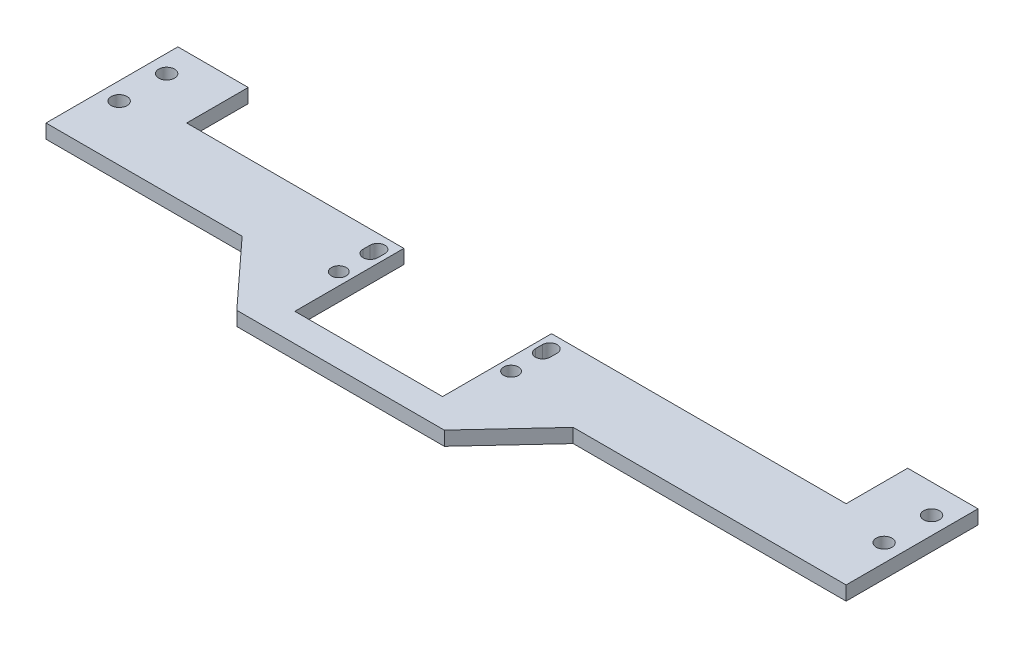
ISO-10303-21;
HEADER;
FILE_DESCRIPTION(('STEP AP214'),'2;1');
FILE_NAME('part.step','',(''),(''),'','','');
FILE_SCHEMA(('AUTOMOTIVE_DESIGN { 1 0 10303 214 1 1 1 1 }'));
ENDSEC;
DATA;
#1=APPLICATION_CONTEXT('core data for automotive mechanical design processes');
#2=APPLICATION_PROTOCOL_DEFINITION('international standard','automotive_design',2000,#1);
#3=PRODUCT_CONTEXT('',#1,'mechanical');
#4=PRODUCT('Part','Part','',(#3));
#5=PRODUCT_RELATED_PRODUCT_CATEGORY('part','',(#4));
#6=PRODUCT_DEFINITION_FORMATION('','',#4);
#7=PRODUCT_DEFINITION_CONTEXT('part definition',#1,'design');
#8=PRODUCT_DEFINITION('design','',#6,#7);
#9=PRODUCT_DEFINITION_SHAPE('','',#8);
#10=(LENGTH_UNIT() NAMED_UNIT(*) SI_UNIT(.MILLI.,.METRE.));
#11=(NAMED_UNIT(*) PLANE_ANGLE_UNIT() SI_UNIT($,.RADIAN.));
#12=(NAMED_UNIT(*) SI_UNIT($,.STERADIAN.) SOLID_ANGLE_UNIT());
#13=UNCERTAINTY_MEASURE_WITH_UNIT(LENGTH_MEASURE(1.E-05),#10,'distance_accuracy_value','');
#14=(GEOMETRIC_REPRESENTATION_CONTEXT(3) GLOBAL_UNCERTAINTY_ASSIGNED_CONTEXT((#13)) GLOBAL_UNIT_ASSIGNED_CONTEXT((#10,
#11,#12)) REPRESENTATION_CONTEXT('',''));
#15=CARTESIAN_POINT('',(0.,0.,0.));
#16=DIRECTION('',(0.,0.,1.));
#17=DIRECTION('',(1.,0.,0.));
#18=AXIS2_PLACEMENT_3D('',#15,#16,#17);
#19=CARTESIAN_POINT('',(0.,4.,0.));
#20=DIRECTION('',(0.,-1.,0.));
#21=DIRECTION('',(0.,0.,-1.));
#22=AXIS2_PLACEMENT_3D('',#19,#20,#21);
#23=PLANE('',#22);
#24=DIRECTION('',(1.,0.,0.));
#25=VECTOR('',#24,1.);
#26=CARTESIAN_POINT('',(-189.553457543323,4.,-5.54443477033133));
#27=LINE('',#26,#25);
#28=CARTESIAN_POINT('',(-206.886892884036,4.,-5.54443477033131));
#29=VERTEX_POINT('',#28);
#30=CARTESIAN_POINT('',(-151.115738532873,4.,-5.54443477033133));
#31=VERTEX_POINT('',#30);
#32=EDGE_CURVE('E223',#29,#31,#27,.T.);
#33=ORIENTED_EDGE('',*,*,#32,.T.);
#34=DIRECTION('',(0.677032314097707,0.,0.735953290411493));
#35=VECTOR('',#34,1.);
#36=CARTESIAN_POINT('',(-133.636892884036,4.,13.4555652296687));
#37=LINE('',#36,#35);
#38=CARTESIAN_POINT('',(-133.636892884036,4.,13.4555652296687));
#39=VERTEX_POINT('',#38);
#40=EDGE_CURVE('E211',#31,#39,#37,.T.);
#41=ORIENTED_EDGE('',*,*,#40,.T.);
#42=DIRECTION('',(1.,0.,0.));
#43=VECTOR('',#42,1.);
#44=CARTESIAN_POINT('',(-133.636892884036,4.,13.4555652296687));
#45=LINE('',#44,#43);
#46=CARTESIAN_POINT('',(-74.6368928840361,4.,13.4555652296687));
#47=VERTEX_POINT('',#46);
#48=EDGE_CURVE('E216',#39,#47,#45,.T.);
#49=ORIENTED_EDGE('',*,*,#48,.T.);
#50=DIRECTION('',(0.680746681944631,0.,-0.732518911033275));
#51=VECTOR('',#50,1.);
#52=CARTESIAN_POINT('',(-56.9797556250085,4.,-5.54443477033133));
#53=LINE('',#52,#51);
#54=CARTESIAN_POINT('',(-56.9797556250085,4.,-5.54443477033133));
#55=VERTEX_POINT('',#54);
#56=EDGE_CURVE('E59',#47,#55,#53,.T.);
#57=ORIENTED_EDGE('',*,*,#56,.T.);
#58=DIRECTION('',(1.,0.,0.));
#59=VECTOR('',#58,1.);
#60=CARTESIAN_POINT('',(-74.6368928840361,4.,-5.54443477033133));
#61=LINE('',#60,#59);
#62=CARTESIAN_POINT('',(20.6131071159638,4.,-5.54443477033133));
#63=VERTEX_POINT('',#62);
#64=EDGE_CURVE('E222',#55,#63,#61,.T.);
#65=ORIENTED_EDGE('',*,*,#64,.T.);
#66=DIRECTION('',(0.,0.,-1.));
#67=VECTOR('',#66,1.);
#68=CARTESIAN_POINT('',(20.6131071159638,4.,-5.54443477033133));
#69=LINE('',#68,#67);
#70=CARTESIAN_POINT('',(20.6131071159638,4.,-43.0444347703313));
#71=VERTEX_POINT('',#70);
#72=EDGE_CURVE('E403',#63,#71,#69,.T.);
#73=ORIENTED_EDGE('',*,*,#72,.T.);
#74=DIRECTION('',(-1.,0.,0.));
#75=VECTOR('',#74,1.);
#76=CARTESIAN_POINT('',(0.613107115963841,4.,-43.0444347703313));
#77=LINE('',#76,#75);
#78=CARTESIAN_POINT('',(0.613107115963841,4.,-43.0444347703313));
#79=VERTEX_POINT('',#78);
#80=EDGE_CURVE('E343',#71,#79,#77,.T.);
#81=ORIENTED_EDGE('',*,*,#80,.T.);
#82=DIRECTION('',(0.,0.,1.));
#83=VECTOR('',#82,1.);
#84=CARTESIAN_POINT('',(0.613107115963841,4.,-43.0444347703313));
#85=LINE('',#84,#83);
#86=CARTESIAN_POINT('',(0.613107115963837,4.,-25.5444347703313));
#87=VERTEX_POINT('',#86);
#88=EDGE_CURVE('E365',#79,#87,#85,.T.);
#89=ORIENTED_EDGE('',*,*,#88,.T.);
#90=DIRECTION('',(-1.,0.,0.));
#91=VECTOR('',#90,1.);
#92=CARTESIAN_POINT('',(-74.6368928840361,4.,-25.5444347703313));
#93=LINE('',#92,#91);
#94=CARTESIAN_POINT('',(-83.1368928840362,4.,-25.5444347703313));
#95=VERTEX_POINT('',#94);
#96=EDGE_CURVE('E361',#87,#95,#93,.T.);
#97=ORIENTED_EDGE('',*,*,#96,.T.);
#98=DIRECTION('',(0.,0.,1.));
#99=VECTOR('',#98,1.);
#100=CARTESIAN_POINT('',(-83.1368928840362,4.,-25.5444347703313));
#101=LINE('',#100,#99);
#102=CARTESIAN_POINT('',(-83.1368928840362,4.,5.45556522966867));
#103=VERTEX_POINT('',#102);
#104=EDGE_CURVE('E364',#95,#103,#101,.T.);
#105=ORIENTED_EDGE('',*,*,#104,.T.);
#106=DIRECTION('',(-1.,0.,0.));
#107=VECTOR('',#106,1.);
#108=CARTESIAN_POINT('',(-83.1368928840362,4.,5.45556522966867));
#109=LINE('',#108,#107);
#110=CARTESIAN_POINT('',(-125.136892884036,4.,5.45556522966867));
#111=VERTEX_POINT('',#110);
#112=EDGE_CURVE('E369',#103,#111,#109,.T.);
#113=ORIENTED_EDGE('',*,*,#112,.T.);
#114=DIRECTION('',(0.,0.,-1.));
#115=VECTOR('',#114,1.);
#116=CARTESIAN_POINT('',(-125.136892884036,4.,-25.5444347703313));
#117=LINE('',#116,#115);
#118=CARTESIAN_POINT('',(-125.136892884036,4.,-25.5444347703313));
#119=VERTEX_POINT('',#118);
#120=EDGE_CURVE('E376',#111,#119,#117,.T.);
#121=ORIENTED_EDGE('',*,*,#120,.T.);
#122=DIRECTION('',(-1.,0.,0.));
#123=VECTOR('',#122,1.);
#124=CARTESIAN_POINT('',(-125.136892884036,4.,-25.5444347703313));
#125=LINE('',#124,#123);
#126=CARTESIAN_POINT('',(-186.886892884036,4.,-25.5444347703313));
#127=VERTEX_POINT('',#126);
#128=EDGE_CURVE('E379',#119,#127,#125,.T.);
#129=ORIENTED_EDGE('',*,*,#128,.T.);
#130=DIRECTION('',(0.,0.,-1.));
#131=VECTOR('',#130,1.);
#132=CARTESIAN_POINT('',(-186.886892884036,4.,-43.0444347703313));
#133=LINE('',#132,#131);
#134=CARTESIAN_POINT('',(-186.886892884036,4.,-43.0444347703313));
#135=VERTEX_POINT('',#134);
#136=EDGE_CURVE('E308',#127,#135,#133,.T.);
#137=ORIENTED_EDGE('',*,*,#136,.T.);
#138=DIRECTION('',(-1.,0.,0.));
#139=VECTOR('',#138,1.);
#140=CARTESIAN_POINT('',(-206.886892884036,4.,-43.0444347703313));
#141=LINE('',#140,#139);
#142=CARTESIAN_POINT('',(-206.886892884036,4.,-43.0444347703313));
#143=VERTEX_POINT('',#142);
#144=EDGE_CURVE('E302',#135,#143,#141,.T.);
#145=ORIENTED_EDGE('',*,*,#144,.T.);
#146=DIRECTION('',(0.,0.,1.));
#147=VECTOR('',#146,1.);
#148=CARTESIAN_POINT('',(-206.886892884036,4.,-43.0444347703313));
#149=LINE('',#148,#147);
#150=EDGE_CURVE('E252',#143,#29,#149,.T.);
#151=ORIENTED_EDGE('',*,*,#150,.T.);
#152=EDGE_LOOP('',(#33,#41,#49,#57,#65,#73,#81,#89,#97,#105,#113,#121,#129,#137,#145,#151));
#153=FACE_BOUND('',#152,.T.);
#154=CARTESIAN_POINT('',(-128.636892884036,4.,-10.5444347703313));
#155=DIRECTION('',(0.,1.,0.));
#156=DIRECTION('',(0.,0.,1.));
#157=AXIS2_PLACEMENT_3D('',#154,#155,#156);
#158=CIRCLE('',#157,2.10000000000002);
#159=CARTESIAN_POINT('',(-128.636892884036,4.,-8.4444347703313));
#160=VERTEX_POINT('',#159);
#161=EDGE_CURVE('E481',#160,#160,#158,.T.);
#162=ORIENTED_EDGE('',*,*,#161,.F.);
#163=EDGE_LOOP('',(#162));
#164=FACE_BOUND('',#163,.T.);
#165=CARTESIAN_POINT('',(-79.6368928840362,4.,-21.5444347703313));
#166=DIRECTION('',(0.,1.,0.));
#167=DIRECTION('',(0.,0.,1.));
#168=AXIS2_PLACEMENT_3D('',#165,#166,#167);
#169=CIRCLE('',#168,2.1);
#170=CARTESIAN_POINT('',(-77.5368928840361,4.,-21.5444347703313));
#171=VERTEX_POINT('',#170);
#172=CARTESIAN_POINT('',(-81.7368928840362,4.,-21.5444347703313));
#173=VERTEX_POINT('',#172);
#174=EDGE_CURVE('E489',#171,#173,#169,.T.);
#175=ORIENTED_EDGE('',*,*,#174,.F.);
#176=DIRECTION('',(0.,0.,-1.));
#177=VECTOR('',#176,1.);
#178=CARTESIAN_POINT('',(-77.5368928840361,4.,-21.5444347703313));
#179=LINE('',#178,#177);
#180=CARTESIAN_POINT('',(-77.5368928840361,4.,-19.5444347703313));
#181=VERTEX_POINT('',#180);
#182=EDGE_CURVE('E500',#181,#171,#179,.T.);
#183=ORIENTED_EDGE('',*,*,#182,.F.);
#184=CARTESIAN_POINT('',(-79.6368928840362,4.,-19.5444347703313));
#185=DIRECTION('',(0.,1.,0.));
#186=DIRECTION('',(0.,0.,1.));
#187=AXIS2_PLACEMENT_3D('',#184,#185,#186);
#188=CIRCLE('',#187,2.1);
#189=CARTESIAN_POINT('',(-81.7368928840362,4.,-19.5444347703313));
#190=VERTEX_POINT('',#189);
#191=EDGE_CURVE('E496',#190,#181,#188,.T.);
#192=ORIENTED_EDGE('',*,*,#191,.F.);
#193=DIRECTION('',(0.,0.,1.));
#194=VECTOR('',#193,1.);
#195=CARTESIAN_POINT('',(-81.7368928840362,4.,-21.5444347703313));
#196=LINE('',#195,#194);
#197=EDGE_CURVE('E492',#173,#190,#196,.T.);
#198=ORIENTED_EDGE('',*,*,#197,.F.);
#199=EDGE_LOOP('',(#175,#183,#192,#198));
#200=FACE_BOUND('',#199,.T.);
#201=CARTESIAN_POINT('',(15.6131071159638,4.,-34.8444347703313));
#202=DIRECTION('',(0.,1.,0.));
#203=DIRECTION('',(0.,0.,1.));
#204=AXIS2_PLACEMENT_3D('',#201,#202,#203);
#205=CIRCLE('',#204,2.25);
#206=CARTESIAN_POINT('',(15.6131071159638,4.,-32.5944347703313));
#207=VERTEX_POINT('',#206);
#208=EDGE_CURVE('E265',#207,#207,#205,.T.);
#209=ORIENTED_EDGE('',*,*,#208,.F.);
#210=EDGE_LOOP('',(#209));
#211=FACE_BOUND('',#210,.T.);
#212=CARTESIAN_POINT('',(15.6131071159639,4.,-21.3444347703313));
#213=DIRECTION('',(0.,1.,0.));
#214=DIRECTION('',(0.,0.,1.));
#215=AXIS2_PLACEMENT_3D('',#212,#213,#214);
#216=CIRCLE('',#215,2.25);
#217=CARTESIAN_POINT('',(15.6131071159639,4.,-19.0944347703313));
#218=VERTEX_POINT('',#217);
#219=EDGE_CURVE('E540',#218,#218,#216,.T.);
#220=ORIENTED_EDGE('',*,*,#219,.F.);
#221=EDGE_LOOP('',(#220));
#222=FACE_BOUND('',#221,.T.);
#223=CARTESIAN_POINT('',(-79.6368928840362,4.,-10.5444347703313));
#224=DIRECTION('',(0.,1.,0.));
#225=DIRECTION('',(0.,0.,1.));
#226=AXIS2_PLACEMENT_3D('',#223,#224,#225);
#227=CIRCLE('',#226,2.1);
#228=CARTESIAN_POINT('',(-79.6368928840362,4.,-8.44443477033133));
#229=VERTEX_POINT('',#228);
#230=EDGE_CURVE('E532',#229,#229,#227,.T.);
#231=ORIENTED_EDGE('',*,*,#230,.F.);
#232=EDGE_LOOP('',(#231));
#233=FACE_BOUND('',#232,.T.);
#234=CARTESIAN_POINT('',(-128.636892884036,4.,-19.5444347703313));
#235=DIRECTION('',(0.,1.,0.));
#236=DIRECTION('',(0.,0.,-1.));
#237=AXIS2_PLACEMENT_3D('',#234,#235,#236);
#238=CIRCLE('',#237,2.1);
#239=CARTESIAN_POINT('',(-130.736892884036,4.,-19.5444347703313));
#240=VERTEX_POINT('',#239);
#241=CARTESIAN_POINT('',(-126.536892884036,4.,-19.5444347703313));
#242=VERTEX_POINT('',#241);
#243=EDGE_CURVE('E440',#240,#242,#238,.T.);
#244=ORIENTED_EDGE('',*,*,#243,.F.);
#245=DIRECTION('',(0.,0.,1.));
#246=VECTOR('',#245,1.);
#247=CARTESIAN_POINT('',(-130.736892884036,4.,-21.5444347703313));
#248=LINE('',#247,#246);
#249=CARTESIAN_POINT('',(-130.736892884036,4.,-21.5444347703313));
#250=VERTEX_POINT('',#249);
#251=EDGE_CURVE('E450',#250,#240,#248,.T.);
#252=ORIENTED_EDGE('',*,*,#251,.F.);
#253=CARTESIAN_POINT('',(-128.636892884036,4.,-21.5444347703313));
#254=DIRECTION('',(0.,1.,0.));
#255=DIRECTION('',(0.,0.,-1.));
#256=AXIS2_PLACEMENT_3D('',#253,#254,#255);
#257=CIRCLE('',#256,2.1);
#258=CARTESIAN_POINT('',(-126.536892884036,4.,-21.5444347703313));
#259=VERTEX_POINT('',#258);
#260=EDGE_CURVE('E447',#259,#250,#257,.T.);
#261=ORIENTED_EDGE('',*,*,#260,.F.);
#262=DIRECTION('',(0.,0.,-1.));
#263=VECTOR('',#262,1.);
#264=CARTESIAN_POINT('',(-126.536892884036,4.,-21.5444347703313));
#265=LINE('',#264,#263);
#266=EDGE_CURVE('E443',#242,#259,#265,.T.);
#267=ORIENTED_EDGE('',*,*,#266,.F.);
#268=EDGE_LOOP('',(#244,#252,#261,#267));
#269=FACE_BOUND('',#268,.T.);
#270=CARTESIAN_POINT('',(-201.886892884036,4.,-34.8444347703313));
#271=DIRECTION('',(0.,1.,0.));
#272=DIRECTION('',(0.,0.,1.));
#273=AXIS2_PLACEMENT_3D('',#270,#271,#272);
#274=CIRCLE('',#273,2.25000000000001);
#275=CARTESIAN_POINT('',(-201.886892884036,4.,-32.5944347703313));
#276=VERTEX_POINT('',#275);
#277=EDGE_CURVE('E432',#276,#276,#274,.T.);
#278=ORIENTED_EDGE('',*,*,#277,.F.);
#279=EDGE_LOOP('',(#278));
#280=FACE_BOUND('',#279,.T.);
#281=CARTESIAN_POINT('',(-201.886892884036,4.,-21.3444347703313));
#282=DIRECTION('',(0.,1.,0.));
#283=DIRECTION('',(0.,0.,1.));
#284=AXIS2_PLACEMENT_3D('',#281,#282,#283);
#285=CIRCLE('',#284,2.25000000000001);
#286=CARTESIAN_POINT('',(-201.886892884036,4.,-19.0944347703313));
#287=VERTEX_POINT('',#286);
#288=EDGE_CURVE('E424',#287,#287,#285,.T.);
#289=ORIENTED_EDGE('',*,*,#288,.F.);
#290=EDGE_LOOP('',(#289));
#291=FACE_BOUND('',#290,.T.);
#292=ADVANCED_FACE('F43',(#153,#164,#200,#211,#222,#233,#269,#280,#291),#23,.F.);
#293=CARTESIAN_POINT('',(0.,0.,0.));
#294=DIRECTION('',(0.,-1.,0.));
#295=DIRECTION('',(0.,0.,-1.));
#296=AXIS2_PLACEMENT_3D('',#293,#294,#295);
#297=PLANE('',#296);
#298=DIRECTION('',(0.677032314097707,0.,0.735953290411493));
#299=VECTOR('',#298,1.);
#300=CARTESIAN_POINT('',(-133.636892884036,0.,13.4555652296687));
#301=LINE('',#300,#299);
#302=CARTESIAN_POINT('',(-151.115738532873,0.,-5.54443477033133));
#303=VERTEX_POINT('',#302);
#304=CARTESIAN_POINT('',(-133.636892884036,0.,13.4555652296687));
#305=VERTEX_POINT('',#304);
#306=EDGE_CURVE('E415',#303,#305,#301,.T.);
#307=ORIENTED_EDGE('',*,*,#306,.F.);
#308=DIRECTION('',(1.,0.,0.));
#309=VECTOR('',#308,1.);
#310=CARTESIAN_POINT('',(-133.636892884036,0.,-5.54443477033133));
#311=LINE('',#310,#309);
#312=CARTESIAN_POINT('',(-206.886892884036,0.,-5.54443477033131));
#313=VERTEX_POINT('',#312);
#314=EDGE_CURVE('E248',#313,#303,#311,.T.);
#315=ORIENTED_EDGE('',*,*,#314,.F.);
#316=DIRECTION('',(0.,0.,1.));
#317=VECTOR('',#316,1.);
#318=CARTESIAN_POINT('',(-206.886892884036,0.,-43.0444347703313));
#319=LINE('',#318,#317);
#320=CARTESIAN_POINT('',(-206.886892884036,0.,-43.0444347703313));
#321=VERTEX_POINT('',#320);
#322=EDGE_CURVE('E254',#321,#313,#319,.T.);
#323=ORIENTED_EDGE('',*,*,#322,.F.);
#324=DIRECTION('',(-1.,0.,0.));
#325=VECTOR('',#324,1.);
#326=CARTESIAN_POINT('',(-206.886892884036,0.,-43.0444347703313));
#327=LINE('',#326,#325);
#328=CARTESIAN_POINT('',(-186.886892884036,0.,-43.0444347703313));
#329=VERTEX_POINT('',#328);
#330=EDGE_CURVE('E260',#329,#321,#327,.T.);
#331=ORIENTED_EDGE('',*,*,#330,.F.);
#332=DIRECTION('',(0.,0.,-1.));
#333=VECTOR('',#332,1.);
#334=CARTESIAN_POINT('',(-186.886892884036,0.,-43.0444347703313));
#335=LINE('',#334,#333);
#336=CARTESIAN_POINT('',(-186.886892884036,0.,-25.5444347703313));
#337=VERTEX_POINT('',#336);
#338=EDGE_CURVE('E299',#337,#329,#335,.T.);
#339=ORIENTED_EDGE('',*,*,#338,.F.);
#340=DIRECTION('',(-1.,0.,0.));
#341=VECTOR('',#340,1.);
#342=CARTESIAN_POINT('',(-125.136892884036,0.,-25.5444347703313));
#343=LINE('',#342,#341);
#344=CARTESIAN_POINT('',(-125.136892884036,0.,-25.5444347703313));
#345=VERTEX_POINT('',#344);
#346=EDGE_CURVE('E296',#345,#337,#343,.T.);
#347=ORIENTED_EDGE('',*,*,#346,.F.);
#348=DIRECTION('',(0.,0.,-1.));
#349=VECTOR('',#348,1.);
#350=CARTESIAN_POINT('',(-125.136892884036,0.,-25.5444347703313));
#351=LINE('',#350,#349);
#352=CARTESIAN_POINT('',(-125.136892884036,0.,5.45556522966867));
#353=VERTEX_POINT('',#352);
#354=EDGE_CURVE('E293',#353,#345,#351,.T.);
#355=ORIENTED_EDGE('',*,*,#354,.F.);
#356=DIRECTION('',(-1.,0.,0.));
#357=VECTOR('',#356,1.);
#358=CARTESIAN_POINT('',(-83.1368928840362,0.,5.45556522966867));
#359=LINE('',#358,#357);
#360=CARTESIAN_POINT('',(-83.1368928840362,0.,5.45556522966867));
#361=VERTEX_POINT('',#360);
#362=EDGE_CURVE('E290',#361,#353,#359,.T.);
#363=ORIENTED_EDGE('',*,*,#362,.F.);
#364=DIRECTION('',(0.,0.,1.));
#365=VECTOR('',#364,1.);
#366=CARTESIAN_POINT('',(-83.1368928840362,0.,-25.5444347703313));
#367=LINE('',#366,#365);
#368=CARTESIAN_POINT('',(-83.1368928840362,0.,-25.5444347703313));
#369=VERTEX_POINT('',#368);
#370=EDGE_CURVE('E287',#369,#361,#367,.T.);
#371=ORIENTED_EDGE('',*,*,#370,.F.);
#372=DIRECTION('',(-1.,0.,0.));
#373=VECTOR('',#372,1.);
#374=CARTESIAN_POINT('',(-83.1368928840362,0.,-25.5444347703313));
#375=LINE('',#374,#373);
#376=CARTESIAN_POINT('',(0.613107115963837,0.,-25.5444347703313));
#377=VERTEX_POINT('',#376);
#378=EDGE_CURVE('E284',#377,#369,#375,.T.);
#379=ORIENTED_EDGE('',*,*,#378,.F.);
#380=DIRECTION('',(0.,0.,1.));
#381=VECTOR('',#380,1.);
#382=CARTESIAN_POINT('',(0.613107115963841,0.,-43.0444347703313));
#383=LINE('',#382,#381);
#384=CARTESIAN_POINT('',(0.613107115963841,0.,-43.0444347703313));
#385=VERTEX_POINT('',#384);
#386=EDGE_CURVE('E280',#385,#377,#383,.T.);
#387=ORIENTED_EDGE('',*,*,#386,.F.);
#388=DIRECTION('',(-1.,0.,0.));
#389=VECTOR('',#388,1.);
#390=CARTESIAN_POINT('',(0.613107115963841,0.,-43.0444347703313));
#391=LINE('',#390,#389);
#392=CARTESIAN_POINT('',(20.6131071159638,0.,-43.0444347703313));
#393=VERTEX_POINT('',#392);
#394=EDGE_CURVE('E277',#393,#385,#391,.T.);
#395=ORIENTED_EDGE('',*,*,#394,.F.);
#396=DIRECTION('',(0.,0.,-1.));
#397=VECTOR('',#396,1.);
#398=CARTESIAN_POINT('',(20.6131071159638,0.,-43.0444347703313));
#399=LINE('',#398,#397);
#400=CARTESIAN_POINT('',(20.6131071159638,0.,-5.54443477033133));
#401=VERTEX_POINT('',#400);
#402=EDGE_CURVE('E274',#401,#393,#399,.T.);
#403=ORIENTED_EDGE('',*,*,#402,.F.);
#404=DIRECTION('',(1.,0.,0.));
#405=VECTOR('',#404,1.);
#406=CARTESIAN_POINT('',(1.27967177525079,0.,-5.54443477033133));
#407=LINE('',#406,#405);
#408=CARTESIAN_POINT('',(-56.9797556250085,0.,-5.54443477033133));
#409=VERTEX_POINT('',#408);
#410=EDGE_CURVE('E271',#409,#401,#407,.T.);
#411=ORIENTED_EDGE('',*,*,#410,.F.);
#412=DIRECTION('',(0.680746681944631,0.,-0.732518911033275));
#413=VECTOR('',#412,1.);
#414=CARTESIAN_POINT('',(-56.9797556250085,0.,-5.54443477033133));
#415=LINE('',#414,#413);
#416=CARTESIAN_POINT('',(-74.6368928840361,0.,13.4555652296687));
#417=VERTEX_POINT('',#416);
#418=EDGE_CURVE('E212',#417,#409,#415,.T.);
#419=ORIENTED_EDGE('',*,*,#418,.F.);
#420=DIRECTION('',(1.,0.,0.));
#421=VECTOR('',#420,1.);
#422=CARTESIAN_POINT('',(-133.636892884036,0.,13.4555652296687));
#423=LINE('',#422,#421);
#424=EDGE_CURVE('E228',#305,#417,#423,.T.);
#425=ORIENTED_EDGE('',*,*,#424,.F.);
#426=EDGE_LOOP('',(#307,#315,#323,#331,#339,#347,#355,#363,#371,#379,#387,#395,#403,#411,#419,#425));
#427=FACE_BOUND('',#426,.T.);
#428=CARTESIAN_POINT('',(-201.886892884036,0.,-34.8444347703313));
#429=DIRECTION('',(0.,1.,0.));
#430=DIRECTION('',(0.,0.,1.));
#431=AXIS2_PLACEMENT_3D('',#428,#429,#430);
#432=CIRCLE('',#431,2.25000000000001);
#433=CARTESIAN_POINT('',(-201.886892884036,0.,-32.5944347703313));
#434=VERTEX_POINT('',#433);
#435=EDGE_CURVE('E428',#434,#434,#432,.T.);
#436=ORIENTED_EDGE('',*,*,#435,.T.);
#437=EDGE_LOOP('',(#436));
#438=FACE_BOUND('',#437,.T.);
#439=DIRECTION('',(0.,0.,-1.));
#440=VECTOR('',#439,1.);
#441=CARTESIAN_POINT('',(-77.5368928840361,0.,-21.5444347703313));
#442=LINE('',#441,#440);
#443=CARTESIAN_POINT('',(-77.5368928840361,0.,-19.5444347703313));
#444=VERTEX_POINT('',#443);
#445=CARTESIAN_POINT('',(-77.5368928840361,0.,-21.5444347703313));
#446=VERTEX_POINT('',#445);
#447=EDGE_CURVE('E493',#444,#446,#442,.T.);
#448=ORIENTED_EDGE('',*,*,#447,.T.);
#449=CARTESIAN_POINT('',(-79.6368928840362,0.,-21.5444347703313));
#450=DIRECTION('',(0.,1.,0.));
#451=DIRECTION('',(0.,0.,1.));
#452=AXIS2_PLACEMENT_3D('',#449,#450,#451);
#453=CIRCLE('',#452,2.1);
#454=CARTESIAN_POINT('',(-81.7368928840362,0.,-21.5444347703313));
#455=VERTEX_POINT('',#454);
#456=EDGE_CURVE('E485',#446,#455,#453,.T.);
#457=ORIENTED_EDGE('',*,*,#456,.T.);
#458=DIRECTION('',(0.,0.,1.));
#459=VECTOR('',#458,1.);
#460=CARTESIAN_POINT('',(-81.7368928840362,0.,-21.5444347703313));
#461=LINE('',#460,#459);
#462=CARTESIAN_POINT('',(-81.7368928840362,0.,-19.5444347703313));
#463=VERTEX_POINT('',#462);
#464=EDGE_CURVE('E507',#455,#463,#461,.T.);
#465=ORIENTED_EDGE('',*,*,#464,.T.);
#466=CARTESIAN_POINT('',(-79.6368928840362,0.,-19.5444347703313));
#467=DIRECTION('',(0.,1.,0.));
#468=DIRECTION('',(0.,0.,1.));
#469=AXIS2_PLACEMENT_3D('',#466,#467,#468);
#470=CIRCLE('',#469,2.1);
#471=EDGE_CURVE('E511',#463,#444,#470,.T.);
#472=ORIENTED_EDGE('',*,*,#471,.T.);
#473=EDGE_LOOP('',(#448,#457,#465,#472));
#474=FACE_BOUND('',#473,.T.);
#475=CARTESIAN_POINT('',(-79.6368928840362,0.,-10.5444347703313));
#476=DIRECTION('',(0.,1.,0.));
#477=DIRECTION('',(0.,0.,1.));
#478=AXIS2_PLACEMENT_3D('',#475,#476,#477);
#479=CIRCLE('',#478,2.1);
#480=CARTESIAN_POINT('',(-79.6368928840362,0.,-8.44443477033133));
#481=VERTEX_POINT('',#480);
#482=EDGE_CURVE('E531',#481,#481,#479,.T.);
#483=ORIENTED_EDGE('',*,*,#482,.T.);
#484=EDGE_LOOP('',(#483));
#485=FACE_BOUND('',#484,.T.);
#486=CARTESIAN_POINT('',(15.6131071159638,0.,-34.8444347703313));
#487=DIRECTION('',(0.,1.,0.));
#488=DIRECTION('',(0.,0.,1.));
#489=AXIS2_PLACEMENT_3D('',#486,#487,#488);
#490=CIRCLE('',#489,2.25);
#491=CARTESIAN_POINT('',(15.6131071159638,0.,-32.5944347703313));
#492=VERTEX_POINT('',#491);
#493=EDGE_CURVE('E396',#492,#492,#490,.T.);
#494=ORIENTED_EDGE('',*,*,#493,.T.);
#495=EDGE_LOOP('',(#494));
#496=FACE_BOUND('',#495,.T.);
#497=CARTESIAN_POINT('',(15.6131071159639,0.,-21.3444347703313));
#498=DIRECTION('',(0.,1.,0.));
#499=DIRECTION('',(0.,0.,1.));
#500=AXIS2_PLACEMENT_3D('',#497,#498,#499);
#501=CIRCLE('',#500,2.25);
#502=CARTESIAN_POINT('',(15.6131071159639,0.,-19.0944347703313));
#503=VERTEX_POINT('',#502);
#504=EDGE_CURVE('E536',#503,#503,#501,.T.);
#505=ORIENTED_EDGE('',*,*,#504,.T.);
#506=EDGE_LOOP('',(#505));
#507=FACE_BOUND('',#506,.T.);
#508=CARTESIAN_POINT('',(-128.636892884036,0.,-10.5444347703313));
#509=DIRECTION('',(0.,1.,0.));
#510=DIRECTION('',(0.,0.,1.));
#511=AXIS2_PLACEMENT_3D('',#508,#509,#510);
#512=CIRCLE('',#511,2.10000000000002);
#513=CARTESIAN_POINT('',(-128.636892884036,0.,-8.4444347703313));
#514=VERTEX_POINT('',#513);
#515=EDGE_CURVE('E480',#514,#514,#512,.T.);
#516=ORIENTED_EDGE('',*,*,#515,.T.);
#517=EDGE_LOOP('',(#516));
#518=FACE_BOUND('',#517,.T.);
#519=DIRECTION('',(0.,0.,1.));
#520=VECTOR('',#519,1.);
#521=CARTESIAN_POINT('',(-130.736892884036,0.,-21.5444347703313));
#522=LINE('',#521,#520);
#523=CARTESIAN_POINT('',(-130.736892884036,0.,-21.5444347703313));
#524=VERTEX_POINT('',#523);
#525=CARTESIAN_POINT('',(-130.736892884036,0.,-19.5444347703313));
#526=VERTEX_POINT('',#525);
#527=EDGE_CURVE('E444',#524,#526,#522,.T.);
#528=ORIENTED_EDGE('',*,*,#527,.T.);
#529=CARTESIAN_POINT('',(-128.636892884036,0.,-19.5444347703313));
#530=DIRECTION('',(0.,1.,0.));
#531=DIRECTION('',(0.,0.,-1.));
#532=AXIS2_PLACEMENT_3D('',#529,#530,#531);
#533=CIRCLE('',#532,2.1);
#534=CARTESIAN_POINT('',(-126.536892884036,0.,-19.5444347703313));
#535=VERTEX_POINT('',#534);
#536=EDGE_CURVE('E436',#526,#535,#533,.T.);
#537=ORIENTED_EDGE('',*,*,#536,.T.);
#538=DIRECTION('',(0.,0.,-1.));
#539=VECTOR('',#538,1.);
#540=CARTESIAN_POINT('',(-126.536892884036,0.,-21.5444347703313));
#541=LINE('',#540,#539);
#542=CARTESIAN_POINT('',(-126.536892884036,0.,-21.5444347703313));
#543=VERTEX_POINT('',#542);
#544=EDGE_CURVE('E457',#535,#543,#541,.T.);
#545=ORIENTED_EDGE('',*,*,#544,.T.);
#546=CARTESIAN_POINT('',(-128.636892884036,0.,-21.5444347703313));
#547=DIRECTION('',(0.,1.,0.));
#548=DIRECTION('',(0.,0.,-1.));
#549=AXIS2_PLACEMENT_3D('',#546,#547,#548);
#550=CIRCLE('',#549,2.1);
#551=EDGE_CURVE('E461',#543,#524,#550,.T.);
#552=ORIENTED_EDGE('',*,*,#551,.T.);
#553=EDGE_LOOP('',(#528,#537,#545,#552));
#554=FACE_BOUND('',#553,.T.);
#555=CARTESIAN_POINT('',(-201.886892884036,0.,-21.3444347703313));
#556=DIRECTION('',(0.,1.,0.));
#557=DIRECTION('',(0.,0.,1.));
#558=AXIS2_PLACEMENT_3D('',#555,#556,#557);
#559=CIRCLE('',#558,2.25000000000001);
#560=CARTESIAN_POINT('',(-201.886892884036,0.,-19.0944347703313));
#561=VERTEX_POINT('',#560);
#562=EDGE_CURVE('E423',#561,#561,#559,.T.);
#563=ORIENTED_EDGE('',*,*,#562,.T.);
#564=EDGE_LOOP('',(#563));
#565=FACE_BOUND('',#564,.T.);
#566=ADVANCED_FACE('F349',(#427,#438,#474,#485,#496,#507,#518,#554,#565),#297,.T.);
#567=CARTESIAN_POINT('',(-206.886892884036,4.,-43.0444347703313));
#568=DIRECTION('',(0.,0.,1.));
#569=DIRECTION('',(1.,0.,0.));
#570=AXIS2_PLACEMENT_3D('',#567,#568,#569);
#571=PLANE('',#570);
#572=ORIENTED_EDGE('',*,*,#330,.T.);
#573=DIRECTION('',(0.,-1.,0.));
#574=VECTOR('',#573,1.);
#575=CARTESIAN_POINT('',(-206.886892884036,4.,-43.0444347703313));
#576=LINE('',#575,#574);
#577=EDGE_CURVE('E11',#143,#321,#576,.T.);
#578=ORIENTED_EDGE('',*,*,#577,.F.);
#579=ORIENTED_EDGE('',*,*,#144,.F.);
#580=DIRECTION('',(0.,-1.,0.));
#581=VECTOR('',#580,1.);
#582=CARTESIAN_POINT('',(-186.886892884036,4.,-43.0444347703313));
#583=LINE('',#582,#581);
#584=EDGE_CURVE('E303',#135,#329,#583,.T.);
#585=ORIENTED_EDGE('',*,*,#584,.T.);
#586=EDGE_LOOP('',(#572,#578,#579,#585));
#587=FACE_BOUND('',#586,.T.);
#588=ADVANCED_FACE('F45',(#587),#571,.F.);
#589=CARTESIAN_POINT('',(-206.886892884036,4.,-43.0444347703313));
#590=DIRECTION('',(1.,0.,0.));
#591=DIRECTION('',(0.,0.,-1.));
#592=AXIS2_PLACEMENT_3D('',#589,#590,#591);
#593=PLANE('',#592);
#594=ORIENTED_EDGE('',*,*,#322,.T.);
#595=DIRECTION('',(0.,-1.,0.));
#596=VECTOR('',#595,1.);
#597=CARTESIAN_POINT('',(-206.886892884036,4.,-5.54443477033131));
#598=LINE('',#597,#596);
#599=EDGE_CURVE('E52',#29,#313,#598,.T.);
#600=ORIENTED_EDGE('',*,*,#599,.F.);
#601=ORIENTED_EDGE('',*,*,#150,.F.);
#602=ORIENTED_EDGE('',*,*,#577,.T.);
#603=EDGE_LOOP('',(#594,#600,#601,#602));
#604=FACE_BOUND('',#603,.T.);
#605=ADVANCED_FACE('F251',(#604),#593,.F.);
#606=CARTESIAN_POINT('',(-133.636892884036,4.,-5.54443477033133));
#607=DIRECTION('',(0.,0.,-1.));
#608=DIRECTION('',(-1.,0.,0.));
#609=AXIS2_PLACEMENT_3D('',#606,#607,#608);
#610=PLANE('',#609);
#611=ORIENTED_EDGE('',*,*,#314,.T.);
#612=DIRECTION('',(0.,1.,0.));
#613=VECTOR('',#612,1.);
#614=CARTESIAN_POINT('',(-151.115738532873,0.,-5.54443477033133));
#615=LINE('',#614,#613);
#616=EDGE_CURVE('E418',#303,#31,#615,.T.);
#617=ORIENTED_EDGE('',*,*,#616,.T.);
#618=ORIENTED_EDGE('',*,*,#32,.F.);
#619=ORIENTED_EDGE('',*,*,#599,.T.);
#620=EDGE_LOOP('',(#611,#617,#618,#619));
#621=FACE_BOUND('',#620,.T.);
#622=ADVANCED_FACE('F246',(#621),#610,.F.);
#623=CARTESIAN_POINT('',(-133.636892884036,4.,13.4555652296687));
#624=DIRECTION('',(0.,0.,-1.));
#625=DIRECTION('',(-1.,0.,0.));
#626=AXIS2_PLACEMENT_3D('',#623,#624,#625);
#627=PLANE('',#626);
#628=ORIENTED_EDGE('',*,*,#424,.T.);
#629=DIRECTION('',(0.,-1.,0.));
#630=VECTOR('',#629,1.);
#631=CARTESIAN_POINT('',(-74.6368928840361,4.,13.4555652296687));
#632=LINE('',#631,#630);
#633=EDGE_CURVE('E205',#47,#417,#632,.T.);
#634=ORIENTED_EDGE('',*,*,#633,.F.);
#635=ORIENTED_EDGE('',*,*,#48,.F.);
#636=DIRECTION('',(0.,-1.,0.));
#637=VECTOR('',#636,1.);
#638=CARTESIAN_POINT('',(-133.636892884036,4.,13.4555652296687));
#639=LINE('',#638,#637);
#640=EDGE_CURVE('E230',#39,#305,#639,.T.);
#641=ORIENTED_EDGE('',*,*,#640,.T.);
#642=EDGE_LOOP('',(#628,#634,#635,#641));
#643=FACE_BOUND('',#642,.T.);
#644=ADVANCED_FACE('F226',(#643),#627,.F.);
#645=CARTESIAN_POINT('',(1.27967177525079,4.,-5.54443477033133));
#646=DIRECTION('',(0.,0.,-1.));
#647=DIRECTION('',(-1.,0.,0.));
#648=AXIS2_PLACEMENT_3D('',#645,#646,#647);
#649=PLANE('',#648);
#650=ORIENTED_EDGE('',*,*,#64,.F.);
#651=DIRECTION('',(0.,1.,0.));
#652=VECTOR('',#651,1.);
#653=CARTESIAN_POINT('',(-56.9797556250085,0.,-5.54443477033133));
#654=LINE('',#653,#652);
#655=EDGE_CURVE('E208',#409,#55,#654,.T.);
#656=ORIENTED_EDGE('',*,*,#655,.F.);
#657=ORIENTED_EDGE('',*,*,#410,.T.);
#658=DIRECTION('',(0.,-1.,0.));
#659=VECTOR('',#658,1.);
#660=CARTESIAN_POINT('',(20.6131071159638,4.,-5.54443477033133));
#661=LINE('',#660,#659);
#662=EDGE_CURVE('E231',#63,#401,#661,.T.);
#663=ORIENTED_EDGE('',*,*,#662,.F.);
#664=EDGE_LOOP('',(#650,#656,#657,#663));
#665=FACE_BOUND('',#664,.T.);
#666=ADVANCED_FACE('F409',(#665),#649,.F.);
#667=CARTESIAN_POINT('',(20.6131071159638,4.,-43.0444347703313));
#668=DIRECTION('',(-1.,0.,0.));
#669=DIRECTION('',(0.,0.,1.));
#670=AXIS2_PLACEMENT_3D('',#667,#668,#669);
#671=PLANE('',#670);
#672=ORIENTED_EDGE('',*,*,#402,.T.);
#673=DIRECTION('',(0.,-1.,0.));
#674=VECTOR('',#673,1.);
#675=CARTESIAN_POINT('',(20.6131071159638,4.,-43.0444347703313));
#676=LINE('',#675,#674);
#677=EDGE_CURVE('E237',#71,#393,#676,.T.);
#678=ORIENTED_EDGE('',*,*,#677,.F.);
#679=ORIENTED_EDGE('',*,*,#72,.F.);
#680=ORIENTED_EDGE('',*,*,#662,.T.);
#681=EDGE_LOOP('',(#672,#678,#679,#680));
#682=FACE_BOUND('',#681,.T.);
#683=ADVANCED_FACE('F407',(#682),#671,.F.);
#684=CARTESIAN_POINT('',(0.613107115963841,4.,-43.0444347703313));
#685=DIRECTION('',(0.,0.,1.));
#686=DIRECTION('',(1.,0.,0.));
#687=AXIS2_PLACEMENT_3D('',#684,#685,#686);
#688=PLANE('',#687);
#689=ORIENTED_EDGE('',*,*,#394,.T.);
#690=DIRECTION('',(0.,-1.,0.));
#691=VECTOR('',#690,1.);
#692=CARTESIAN_POINT('',(0.613107115963841,4.,-43.0444347703313));
#693=LINE('',#692,#691);
#694=EDGE_CURVE('E332',#79,#385,#693,.T.);
#695=ORIENTED_EDGE('',*,*,#694,.F.);
#696=ORIENTED_EDGE('',*,*,#80,.F.);
#697=ORIENTED_EDGE('',*,*,#677,.T.);
#698=EDGE_LOOP('',(#689,#695,#696,#697));
#699=FACE_BOUND('',#698,.T.);
#700=ADVANCED_FACE('F341',(#699),#688,.F.);
#701=CARTESIAN_POINT('',(0.613107115963841,4.,-43.0444347703313));
#702=DIRECTION('',(1.,0.,0.));
#703=DIRECTION('',(0.,0.,-1.));
#704=AXIS2_PLACEMENT_3D('',#701,#702,#703);
#705=PLANE('',#704);
#706=ORIENTED_EDGE('',*,*,#386,.T.);
#707=DIRECTION('',(0.,-1.,0.));
#708=VECTOR('',#707,1.);
#709=CARTESIAN_POINT('',(0.613107115963837,4.,-25.5444347703313));
#710=LINE('',#709,#708);
#711=EDGE_CURVE('E328',#87,#377,#710,.T.);
#712=ORIENTED_EDGE('',*,*,#711,.F.);
#713=ORIENTED_EDGE('',*,*,#88,.F.);
#714=ORIENTED_EDGE('',*,*,#694,.T.);
#715=EDGE_LOOP('',(#706,#712,#713,#714));
#716=FACE_BOUND('',#715,.T.);
#717=ADVANCED_FACE('F355',(#716),#705,.F.);
#718=CARTESIAN_POINT('',(-83.1368928840362,4.,-25.5444347703313));
#719=DIRECTION('',(0.,0.,1.));
#720=DIRECTION('',(1.,0.,0.));
#721=AXIS2_PLACEMENT_3D('',#718,#719,#720);
#722=PLANE('',#721);
#723=ORIENTED_EDGE('',*,*,#378,.T.);
#724=DIRECTION('',(0.,-1.,0.));
#725=VECTOR('',#724,1.);
#726=CARTESIAN_POINT('',(-83.1368928840362,4.,-25.5444347703313));
#727=LINE('',#726,#725);
#728=EDGE_CURVE('E324',#95,#369,#727,.T.);
#729=ORIENTED_EDGE('',*,*,#728,.F.);
#730=ORIENTED_EDGE('',*,*,#96,.F.);
#731=ORIENTED_EDGE('',*,*,#711,.T.);
#732=EDGE_LOOP('',(#723,#729,#730,#731));
#733=FACE_BOUND('',#732,.T.);
#734=ADVANCED_FACE('F359',(#733),#722,.F.);
#735=CARTESIAN_POINT('',(-83.1368928840362,4.,-25.5444347703313));
#736=DIRECTION('',(1.,0.,0.));
#737=DIRECTION('',(0.,0.,-1.));
#738=AXIS2_PLACEMENT_3D('',#735,#736,#737);
#739=PLANE('',#738);
#740=ORIENTED_EDGE('',*,*,#370,.T.);
#741=DIRECTION('',(0.,-1.,0.));
#742=VECTOR('',#741,1.);
#743=CARTESIAN_POINT('',(-83.1368928840362,4.,5.45556522966867));
#744=LINE('',#743,#742);
#745=EDGE_CURVE('E320',#103,#361,#744,.T.);
#746=ORIENTED_EDGE('',*,*,#745,.F.);
#747=ORIENTED_EDGE('',*,*,#104,.F.);
#748=ORIENTED_EDGE('',*,*,#728,.T.);
#749=EDGE_LOOP('',(#740,#746,#747,#748));
#750=FACE_BOUND('',#749,.T.);
#751=ADVANCED_FACE('F587',(#750),#739,.F.);
#752=CARTESIAN_POINT('',(-83.1368928840362,4.,5.45556522966867));
#753=DIRECTION('',(0.,0.,1.));
#754=DIRECTION('',(1.,0.,0.));
#755=AXIS2_PLACEMENT_3D('',#752,#753,#754);
#756=PLANE('',#755);
#757=ORIENTED_EDGE('',*,*,#362,.T.);
#758=DIRECTION('',(0.,-1.,0.));
#759=VECTOR('',#758,1.);
#760=CARTESIAN_POINT('',(-125.136892884036,4.,5.45556522966867));
#761=LINE('',#760,#759);
#762=EDGE_CURVE('E316',#111,#353,#761,.T.);
#763=ORIENTED_EDGE('',*,*,#762,.F.);
#764=ORIENTED_EDGE('',*,*,#112,.F.);
#765=ORIENTED_EDGE('',*,*,#745,.T.);
#766=EDGE_LOOP('',(#757,#763,#764,#765));
#767=FACE_BOUND('',#766,.T.);
#768=ADVANCED_FACE('F583',(#767),#756,.F.);
#769=CARTESIAN_POINT('',(-125.136892884036,4.,-25.5444347703313));
#770=DIRECTION('',(-1.,0.,0.));
#771=DIRECTION('',(0.,0.,1.));
#772=AXIS2_PLACEMENT_3D('',#769,#770,#771);
#773=PLANE('',#772);
#774=ORIENTED_EDGE('',*,*,#354,.T.);
#775=DIRECTION('',(0.,-1.,0.));
#776=VECTOR('',#775,1.);
#777=CARTESIAN_POINT('',(-125.136892884036,4.,-25.5444347703313));
#778=LINE('',#777,#776);
#779=EDGE_CURVE('E312',#119,#345,#778,.T.);
#780=ORIENTED_EDGE('',*,*,#779,.F.);
#781=ORIENTED_EDGE('',*,*,#120,.F.);
#782=ORIENTED_EDGE('',*,*,#762,.T.);
#783=EDGE_LOOP('',(#774,#780,#781,#782));
#784=FACE_BOUND('',#783,.T.);
#785=ADVANCED_FACE('F579',(#784),#773,.F.);
#786=CARTESIAN_POINT('',(-125.136892884036,4.,-25.5444347703313));
#787=DIRECTION('',(0.,0.,1.));
#788=DIRECTION('',(1.,0.,0.));
#789=AXIS2_PLACEMENT_3D('',#786,#787,#788);
#790=PLANE('',#789);
#791=ORIENTED_EDGE('',*,*,#346,.T.);
#792=DIRECTION('',(0.,-1.,0.));
#793=VECTOR('',#792,1.);
#794=CARTESIAN_POINT('',(-186.886892884036,4.,-25.5444347703313));
#795=LINE('',#794,#793);
#796=EDGE_CURVE('E307',#127,#337,#795,.T.);
#797=ORIENTED_EDGE('',*,*,#796,.F.);
#798=ORIENTED_EDGE('',*,*,#128,.F.);
#799=ORIENTED_EDGE('',*,*,#779,.T.);
#800=EDGE_LOOP('',(#791,#797,#798,#799));
#801=FACE_BOUND('',#800,.T.);
#802=ADVANCED_FACE('F567',(#801),#790,.F.);
#803=CARTESIAN_POINT('',(-186.886892884036,4.,-43.0444347703313));
#804=DIRECTION('',(-1.,0.,0.));
#805=DIRECTION('',(0.,0.,1.));
#806=AXIS2_PLACEMENT_3D('',#803,#804,#805);
#807=PLANE('',#806);
#808=ORIENTED_EDGE('',*,*,#338,.T.);
#809=ORIENTED_EDGE('',*,*,#584,.F.);
#810=ORIENTED_EDGE('',*,*,#136,.F.);
#811=ORIENTED_EDGE('',*,*,#796,.T.);
#812=EDGE_LOOP('',(#808,#809,#810,#811));
#813=FACE_BOUND('',#812,.T.);
#814=ADVANCED_FACE('F388',(#813),#807,.F.);
#815=CARTESIAN_POINT('',(15.6131071159638,4.,-34.8444347703313));
#816=DIRECTION('',(0.,-1.,0.));
#817=DIRECTION('',(0.,0.,-1.));
#818=AXIS2_PLACEMENT_3D('',#815,#816,#817);
#819=CYLINDRICAL_SURFACE('',#818,2.25);
#820=ORIENTED_EDGE('',*,*,#208,.T.);
#821=EDGE_LOOP('',(#820));
#822=FACE_BOUND('',#821,.T.);
#823=ORIENTED_EDGE('',*,*,#493,.F.);
#824=EDGE_LOOP('',(#823));
#825=FACE_BOUND('',#824,.T.);
#826=ADVANCED_FACE('F556',(#822,#825),#819,.F.);
#827=CARTESIAN_POINT('',(15.6131071159639,4.,-21.3444347703313));
#828=DIRECTION('',(0.,-1.,0.));
#829=DIRECTION('',(0.,0.,-1.));
#830=AXIS2_PLACEMENT_3D('',#827,#828,#829);
#831=CYLINDRICAL_SURFACE('',#830,2.25);
#832=ORIENTED_EDGE('',*,*,#219,.T.);
#833=EDGE_LOOP('',(#832));
#834=FACE_BOUND('',#833,.T.);
#835=ORIENTED_EDGE('',*,*,#504,.F.);
#836=EDGE_LOOP('',(#835));
#837=FACE_BOUND('',#836,.T.);
#838=ADVANCED_FACE('F558',(#834,#837),#831,.F.);
#839=CARTESIAN_POINT('',(-79.6368928840362,4.,-10.5444347703313));
#840=DIRECTION('',(0.,-1.,0.));
#841=DIRECTION('',(0.,0.,-1.));
#842=AXIS2_PLACEMENT_3D('',#839,#840,#841);
#843=CYLINDRICAL_SURFACE('',#842,2.1);
#844=ORIENTED_EDGE('',*,*,#230,.T.);
#845=EDGE_LOOP('',(#844));
#846=FACE_BOUND('',#845,.T.);
#847=ORIENTED_EDGE('',*,*,#482,.F.);
#848=EDGE_LOOP('',(#847));
#849=FACE_BOUND('',#848,.T.);
#850=ADVANCED_FACE('F564',(#846,#849),#843,.F.);
#851=CARTESIAN_POINT('',(-79.6368928840362,4.,-21.5444347703313));
#852=DIRECTION('',(0.,-1.,0.));
#853=DIRECTION('',(0.,0.,-1.));
#854=AXIS2_PLACEMENT_3D('',#851,#852,#853);
#855=CYLINDRICAL_SURFACE('',#854,2.1);
#856=ORIENTED_EDGE('',*,*,#456,.F.);
#857=DIRECTION('',(0.,-1.,0.));
#858=VECTOR('',#857,1.);
#859=CARTESIAN_POINT('',(-77.5368928840361,4.,-21.5444347703313));
#860=LINE('',#859,#858);
#861=EDGE_CURVE('E503',#171,#446,#860,.T.);
#862=ORIENTED_EDGE('',*,*,#861,.F.);
#863=ORIENTED_EDGE('',*,*,#174,.T.);
#864=DIRECTION('',(0.,-1.,0.));
#865=VECTOR('',#864,1.);
#866=CARTESIAN_POINT('',(-81.7368928840362,4.,-21.5444347703313));
#867=LINE('',#866,#865);
#868=EDGE_CURVE('E527',#173,#455,#867,.T.);
#869=ORIENTED_EDGE('',*,*,#868,.T.);
#870=EDGE_LOOP('',(#856,#862,#863,#869));
#871=FACE_BOUND('',#870,.T.);
#872=ADVANCED_FACE('F705',(#871),#855,.F.);
#873=CARTESIAN_POINT('',(-81.7368928840362,4.,-21.5444347703313));
#874=DIRECTION('',(1.,0.,0.));
#875=DIRECTION('',(0.,0.,-1.));
#876=AXIS2_PLACEMENT_3D('',#873,#874,#875);
#877=PLANE('',#876);
#878=ORIENTED_EDGE('',*,*,#464,.F.);
#879=ORIENTED_EDGE('',*,*,#868,.F.);
#880=ORIENTED_EDGE('',*,*,#197,.T.);
#881=DIRECTION('',(0.,-1.,0.));
#882=VECTOR('',#881,1.);
#883=CARTESIAN_POINT('',(-81.7368928840362,4.,-19.5444347703313));
#884=LINE('',#883,#882);
#885=EDGE_CURVE('E524',#190,#463,#884,.T.);
#886=ORIENTED_EDGE('',*,*,#885,.T.);
#887=EDGE_LOOP('',(#878,#879,#880,#886));
#888=FACE_BOUND('',#887,.T.);
#889=ADVANCED_FACE('F716',(#888),#877,.T.);
#890=CARTESIAN_POINT('',(-79.6368928840362,4.,-19.5444347703313));
#891=DIRECTION('',(0.,-1.,0.));
#892=DIRECTION('',(0.,0.,-1.));
#893=AXIS2_PLACEMENT_3D('',#890,#891,#892);
#894=CYLINDRICAL_SURFACE('',#893,2.1);
#895=ORIENTED_EDGE('',*,*,#471,.F.);
#896=ORIENTED_EDGE('',*,*,#885,.F.);
#897=ORIENTED_EDGE('',*,*,#191,.T.);
#898=DIRECTION('',(0.,-1.,0.));
#899=VECTOR('',#898,1.);
#900=CARTESIAN_POINT('',(-77.5368928840361,4.,-19.5444347703313));
#901=LINE('',#900,#899);
#902=EDGE_CURVE('E521',#181,#444,#901,.T.);
#903=ORIENTED_EDGE('',*,*,#902,.T.);
#904=EDGE_LOOP('',(#895,#896,#897,#903));
#905=FACE_BOUND('',#904,.T.);
#906=ADVANCED_FACE('F727',(#905),#894,.F.);
#907=CARTESIAN_POINT('',(-77.5368928840361,4.,-21.5444347703313));
#908=DIRECTION('',(-1.,0.,0.));
#909=DIRECTION('',(0.,0.,1.));
#910=AXIS2_PLACEMENT_3D('',#907,#908,#909);
#911=PLANE('',#910);
#912=ORIENTED_EDGE('',*,*,#447,.F.);
#913=ORIENTED_EDGE('',*,*,#902,.F.);
#914=ORIENTED_EDGE('',*,*,#182,.T.);
#915=ORIENTED_EDGE('',*,*,#861,.T.);
#916=EDGE_LOOP('',(#912,#913,#914,#915));
#917=FACE_BOUND('',#916,.T.);
#918=ADVANCED_FACE('F738',(#917),#911,.T.);
#919=CARTESIAN_POINT('',(-128.636892884036,4.,-10.5444347703313));
#920=DIRECTION('',(0.,-1.,0.));
#921=DIRECTION('',(0.,0.,-1.));
#922=AXIS2_PLACEMENT_3D('',#919,#920,#921);
#923=CYLINDRICAL_SURFACE('',#922,2.10000000000002);
#924=ORIENTED_EDGE('',*,*,#161,.T.);
#925=EDGE_LOOP('',(#924));
#926=FACE_BOUND('',#925,.T.);
#927=ORIENTED_EDGE('',*,*,#515,.F.);
#928=EDGE_LOOP('',(#927));
#929=FACE_BOUND('',#928,.T.);
#930=ADVANCED_FACE('F749',(#926,#929),#923,.F.);
#931=CARTESIAN_POINT('',(-128.636892884036,4.,-19.5444347703313));
#932=DIRECTION('',(0.,-1.,0.));
#933=DIRECTION('',(0.,0.,-1.));
#934=AXIS2_PLACEMENT_3D('',#931,#932,#933);
#935=CYLINDRICAL_SURFACE('',#934,2.1);
#936=ORIENTED_EDGE('',*,*,#536,.F.);
#937=DIRECTION('',(0.,-1.,0.));
#938=VECTOR('',#937,1.);
#939=CARTESIAN_POINT('',(-130.736892884036,4.,-19.5444347703313));
#940=LINE('',#939,#938);
#941=EDGE_CURVE('E453',#240,#526,#940,.T.);
#942=ORIENTED_EDGE('',*,*,#941,.F.);
#943=ORIENTED_EDGE('',*,*,#243,.T.);
#944=DIRECTION('',(0.,-1.,0.));
#945=VECTOR('',#944,1.);
#946=CARTESIAN_POINT('',(-126.536892884036,4.,-19.5444347703313));
#947=LINE('',#946,#945);
#948=EDGE_CURVE('E476',#242,#535,#947,.T.);
#949=ORIENTED_EDGE('',*,*,#948,.T.);
#950=EDGE_LOOP('',(#936,#942,#943,#949));
#951=FACE_BOUND('',#950,.T.);
#952=ADVANCED_FACE('F760',(#951),#935,.F.);
#953=CARTESIAN_POINT('',(-126.536892884036,4.,-21.5444347703313));
#954=DIRECTION('',(-1.,0.,0.));
#955=DIRECTION('',(0.,0.,1.));
#956=AXIS2_PLACEMENT_3D('',#953,#954,#955);
#957=PLANE('',#956);
#958=ORIENTED_EDGE('',*,*,#544,.F.);
#959=ORIENTED_EDGE('',*,*,#948,.F.);
#960=ORIENTED_EDGE('',*,*,#266,.T.);
#961=DIRECTION('',(0.,-1.,0.));
#962=VECTOR('',#961,1.);
#963=CARTESIAN_POINT('',(-126.536892884036,4.,-21.5444347703313));
#964=LINE('',#963,#962);
#965=EDGE_CURVE('E473',#259,#543,#964,.T.);
#966=ORIENTED_EDGE('',*,*,#965,.T.);
#967=EDGE_LOOP('',(#958,#959,#960,#966));
#968=FACE_BOUND('',#967,.T.);
#969=ADVANCED_FACE('F771',(#968),#957,.T.);
#970=CARTESIAN_POINT('',(-128.636892884036,4.,-21.5444347703313));
#971=DIRECTION('',(0.,-1.,0.));
#972=DIRECTION('',(0.,0.,-1.));
#973=AXIS2_PLACEMENT_3D('',#970,#971,#972);
#974=CYLINDRICAL_SURFACE('',#973,2.1);
#975=ORIENTED_EDGE('',*,*,#551,.F.);
#976=ORIENTED_EDGE('',*,*,#965,.F.);
#977=ORIENTED_EDGE('',*,*,#260,.T.);
#978=DIRECTION('',(0.,-1.,0.));
#979=VECTOR('',#978,1.);
#980=CARTESIAN_POINT('',(-130.736892884036,4.,-21.5444347703313));
#981=LINE('',#980,#979);
#982=EDGE_CURVE('E67',#250,#524,#981,.T.);
#983=ORIENTED_EDGE('',*,*,#982,.T.);
#984=EDGE_LOOP('',(#975,#976,#977,#983));
#985=FACE_BOUND('',#984,.T.);
#986=ADVANCED_FACE('F782',(#985),#974,.F.);
#987=CARTESIAN_POINT('',(-130.736892884036,4.,-21.5444347703313));
#988=DIRECTION('',(1.,0.,0.));
#989=DIRECTION('',(0.,0.,-1.));
#990=AXIS2_PLACEMENT_3D('',#987,#988,#989);
#991=PLANE('',#990);
#992=ORIENTED_EDGE('',*,*,#527,.F.);
#993=ORIENTED_EDGE('',*,*,#982,.F.);
#994=ORIENTED_EDGE('',*,*,#251,.T.);
#995=ORIENTED_EDGE('',*,*,#941,.T.);
#996=EDGE_LOOP('',(#992,#993,#994,#995));
#997=FACE_BOUND('',#996,.T.);
#998=ADVANCED_FACE('F793',(#997),#991,.T.);
#999=CARTESIAN_POINT('',(-201.886892884036,4.,-34.8444347703313));
#1000=DIRECTION('',(0.,-1.,0.));
#1001=DIRECTION('',(0.,0.,-1.));
#1002=AXIS2_PLACEMENT_3D('',#999,#1000,#1001);
#1003=CYLINDRICAL_SURFACE('',#1002,2.25000000000001);
#1004=ORIENTED_EDGE('',*,*,#277,.T.);
#1005=EDGE_LOOP('',(#1004));
#1006=FACE_BOUND('',#1005,.T.);
#1007=ORIENTED_EDGE('',*,*,#435,.F.);
#1008=EDGE_LOOP('',(#1007));
#1009=FACE_BOUND('',#1008,.T.);
#1010=ADVANCED_FACE('F804',(#1006,#1009),#1003,.F.);
#1011=CARTESIAN_POINT('',(-201.886892884036,4.,-21.3444347703313));
#1012=DIRECTION('',(0.,-1.,0.));
#1013=DIRECTION('',(0.,0.,-1.));
#1014=AXIS2_PLACEMENT_3D('',#1011,#1012,#1013);
#1015=CYLINDRICAL_SURFACE('',#1014,2.25000000000001);
#1016=ORIENTED_EDGE('',*,*,#288,.T.);
#1017=EDGE_LOOP('',(#1016));
#1018=FACE_BOUND('',#1017,.T.);
#1019=ORIENTED_EDGE('',*,*,#562,.F.);
#1020=EDGE_LOOP('',(#1019));
#1021=FACE_BOUND('',#1020,.T.);
#1022=ADVANCED_FACE('F814',(#1018,#1021),#1015,.F.);
#1023=CARTESIAN_POINT('',(-133.636892884036,0.,13.4555652296687));
#1024=DIRECTION('',(-0.735953290411493,0.,0.677032314097707));
#1025=DIRECTION('',(0.677032314097707,0.,0.735953290411493));
#1026=AXIS2_PLACEMENT_3D('',#1023,#1024,#1025);
#1027=PLANE('',#1026);
#1028=ORIENTED_EDGE('',*,*,#40,.F.);
#1029=ORIENTED_EDGE('',*,*,#616,.F.);
#1030=ORIENTED_EDGE('',*,*,#306,.T.);
#1031=ORIENTED_EDGE('',*,*,#640,.F.);
#1032=EDGE_LOOP('',(#1028,#1029,#1030,#1031));
#1033=FACE_BOUND('',#1032,.T.);
#1034=ADVANCED_FACE('F823',(#1033),#1027,.T.);
#1035=CARTESIAN_POINT('',(-56.9797556250085,0.,-5.54443477033133));
#1036=DIRECTION('',(0.732518911033275,0.,0.680746681944631));
#1037=DIRECTION('',(0.680746681944631,0.,-0.732518911033275));
#1038=AXIS2_PLACEMENT_3D('',#1035,#1036,#1037);
#1039=PLANE('',#1038);
#1040=ORIENTED_EDGE('',*,*,#56,.F.);
#1041=ORIENTED_EDGE('',*,*,#633,.T.);
#1042=ORIENTED_EDGE('',*,*,#418,.T.);
#1043=ORIENTED_EDGE('',*,*,#655,.T.);
#1044=EDGE_LOOP('',(#1040,#1041,#1042,#1043));
#1045=FACE_BOUND('',#1044,.T.);
#1046=ADVANCED_FACE('F203',(#1045),#1039,.T.);
#1047=CLOSED_SHELL('',(#292,#566,#588,#605,#622,#644,#666,#683,#700,#717,#734,#751,#768,#785,
#802,#814,#826,#838,#850,#872,#889,#906,#918,#930,#952,#969,#986,#998,#1010,#1022,#1034,#1046));
#1048=MANIFOLD_SOLID_BREP('B2',#1047);
#1049=ADVANCED_BREP_SHAPE_REPRESENTATION('',(#18,#1048),#14);
#1050=SHAPE_DEFINITION_REPRESENTATION(#9,#1049);
ENDSEC;
END-ISO-10303-21;
